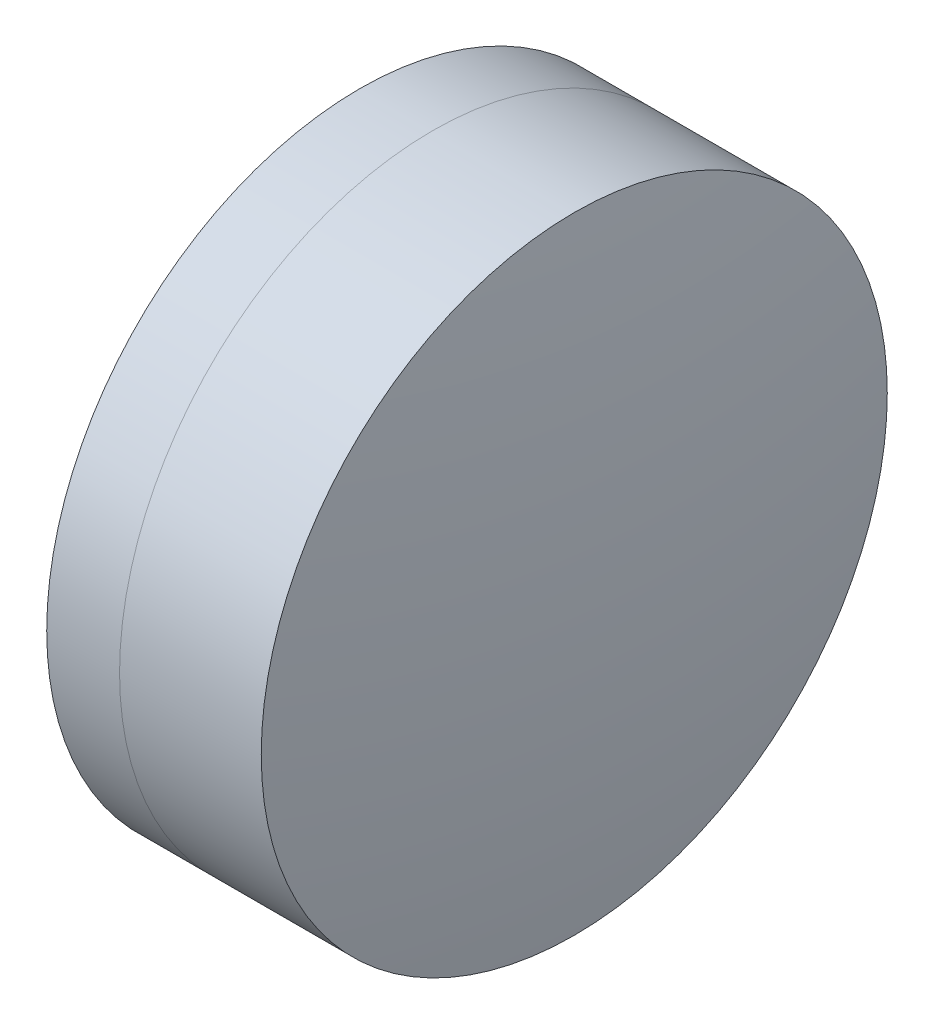
ISO-10303-21;
HEADER;
FILE_DESCRIPTION(('STEP AP214'),'2;1');
FILE_NAME('part.step','',(''),(''),'','','');
FILE_SCHEMA(('AUTOMOTIVE_DESIGN { 1 0 10303 214 1 1 1 1 }'));
ENDSEC;
DATA;
#1=APPLICATION_CONTEXT('core data for automotive mechanical design processes');
#2=APPLICATION_PROTOCOL_DEFINITION('international standard','automotive_design',2000,#1);
#3=PRODUCT_CONTEXT('',#1,'mechanical');
#4=PRODUCT('Part','Part','',(#3));
#5=PRODUCT_RELATED_PRODUCT_CATEGORY('part','',(#4));
#6=PRODUCT_DEFINITION_FORMATION('','',#4);
#7=PRODUCT_DEFINITION_CONTEXT('part definition',#1,'design');
#8=PRODUCT_DEFINITION('design','',#6,#7);
#9=PRODUCT_DEFINITION_SHAPE('','',#8);
#10=(LENGTH_UNIT() NAMED_UNIT(*) SI_UNIT(.MILLI.,.METRE.));
#11=(NAMED_UNIT(*) PLANE_ANGLE_UNIT() SI_UNIT($,.RADIAN.));
#12=(NAMED_UNIT(*) SI_UNIT($,.STERADIAN.) SOLID_ANGLE_UNIT());
#13=UNCERTAINTY_MEASURE_WITH_UNIT(LENGTH_MEASURE(1.E-05),#10,'distance_accuracy_value','');
#14=(GEOMETRIC_REPRESENTATION_CONTEXT(3) GLOBAL_UNCERTAINTY_ASSIGNED_CONTEXT((#13)) GLOBAL_UNIT_ASSIGNED_CONTEXT((#10,
#11,#12)) REPRESENTATION_CONTEXT('',''));
#15=CARTESIAN_POINT('',(0.,0.,0.));
#16=DIRECTION('',(0.,0.,1.));
#17=DIRECTION('',(1.,0.,0.));
#18=AXIS2_PLACEMENT_3D('',#15,#16,#17);
#19=CARTESIAN_POINT('',(-11.8070792192613,0.,0.));
#20=DIRECTION('',(-1.,0.,0.));
#21=DIRECTION('',(0.,0.,1.));
#22=AXIS2_PLACEMENT_3D('',#19,#20,#21);
#23=SPHERICAL_SURFACE('',#22,14.496);
#24=CARTESIAN_POINT('',(1.27235180811907,0.,0.));
#25=DIRECTION('',(-1.,0.,0.));
#26=DIRECTION('',(0.,0.,1.));
#27=AXIS2_PLACEMENT_3D('',#24,#25,#26);
#28=CIRCLE('',#27,6.25);
#29=CARTESIAN_POINT('',(1.27235180811907,0.,6.25));
#30=VERTEX_POINT('',#29);
#31=EDGE_CURVE('E11',#30,#30,#28,.T.);
#32=ORIENTED_EDGE('',*,*,#31,.T.);
#33=EDGE_LOOP('',(#32));
#34=FACE_BOUND('',#33,.T.);
#35=ADVANCED_FACE('F45',(#34),#23,.F.);
#36=CARTESIAN_POINT('',(-0.551919992657797,0.,0.));
#37=DIRECTION('',(-1.,0.,0.));
#38=DIRECTION('',(0.,0.,1.));
#39=AXIS2_PLACEMENT_3D('',#36,#37,#38);
#40=CYLINDRICAL_SURFACE('',#39,6.25);
#41=CARTESIAN_POINT('',(4.1013985704652,0.,0.));
#42=DIRECTION('',(-1.,0.,0.));
#43=DIRECTION('',(0.,0.,1.));
#44=AXIS2_PLACEMENT_3D('',#41,#42,#43);
#45=CIRCLE('',#44,6.25);
#46=CARTESIAN_POINT('',(4.1013985704652,0.,6.25));
#47=VERTEX_POINT('',#46);
#48=EDGE_CURVE('E51',#47,#47,#45,.T.);
#49=ORIENTED_EDGE('',*,*,#48,.T.);
#50=EDGE_LOOP('',(#49));
#51=FACE_BOUND('',#50,.T.);
#52=ORIENTED_EDGE('',*,*,#31,.F.);
#53=EDGE_LOOP('',(#52));
#54=FACE_BOUND('',#53,.T.);
#55=ADVANCED_FACE('F57',(#51,#54),#40,.T.);
#56=CARTESIAN_POINT('',(-36.5610792192613,0.,0.));
#57=DIRECTION('',(-1.,0.,0.));
#58=DIRECTION('',(0.,0.,1.));
#59=AXIS2_PLACEMENT_3D('',#56,#57,#58);
#60=SPHERICAL_SURFACE('',#59,41.14);
#61=ORIENTED_EDGE('',*,*,#48,.F.);
#62=EDGE_LOOP('',(#61));
#63=FACE_BOUND('',#62,.T.);
#64=ADVANCED_FACE('F60',(#63),#60,.T.);
#65=CLOSED_SHELL('',(#35,#55,#64));
#66=MANIFOLD_SOLID_BREP('B2',#65);
#67=CARTESIAN_POINT('',(19.2789207807387,0.,0.));
#68=DIRECTION('',(-1.,0.,0.));
#69=DIRECTION('',(0.,0.,1.));
#70=AXIS2_PLACEMENT_3D('',#67,#68,#69);
#71=SPHERICAL_SURFACE('',#70,20.44);
#72=CARTESIAN_POINT('',(-0.182094095161263,0.,0.));
#73=DIRECTION('',(-1.,0.,0.));
#74=DIRECTION('',(0.,0.,1.));
#75=AXIS2_PLACEMENT_3D('',#72,#73,#74);
#76=CIRCLE('',#75,6.25);
#77=CARTESIAN_POINT('',(-0.182094095161263,0.,6.25));
#78=VERTEX_POINT('',#77);
#79=EDGE_CURVE('E44',#78,#78,#76,.T.);
#80=ORIENTED_EDGE('',*,*,#79,.T.);
#81=EDGE_LOOP('',(#80));
#82=FACE_BOUND('',#81,.T.);
#83=ADVANCED_FACE('F86',(#82),#71,.T.);
#84=CARTESIAN_POINT('',(-9.70261217833668,0.,0.));
#85=DIRECTION('',(-1.,0.,0.));
#86=DIRECTION('',(0.,0.,1.));
#87=AXIS2_PLACEMENT_3D('',#84,#85,#86);
#88=CYLINDRICAL_SURFACE('',#87,6.25);
#89=CARTESIAN_POINT('',(1.27235180811907,0.,0.));
#90=DIRECTION('',(-1.,0.,0.));
#91=DIRECTION('',(0.,0.,1.));
#92=AXIS2_PLACEMENT_3D('',#89,#90,#91);
#93=CIRCLE('',#92,6.25);
#94=CARTESIAN_POINT('',(1.27235180811907,0.,6.25));
#95=VERTEX_POINT('',#94);
#96=EDGE_CURVE('E92',#95,#95,#93,.T.);
#97=ORIENTED_EDGE('',*,*,#96,.T.);
#98=EDGE_LOOP('',(#97));
#99=FACE_BOUND('',#98,.T.);
#100=ORIENTED_EDGE('',*,*,#79,.F.);
#101=EDGE_LOOP('',(#100));
#102=FACE_BOUND('',#101,.T.);
#103=ADVANCED_FACE('F98',(#99,#102),#88,.T.);
#104=CARTESIAN_POINT('',(-11.8070792192613,0.,0.));
#105=DIRECTION('',(-1.,0.,0.));
#106=DIRECTION('',(0.,0.,1.));
#107=AXIS2_PLACEMENT_3D('',#104,#105,#106);
#108=SPHERICAL_SURFACE('',#107,14.496);
#109=ORIENTED_EDGE('',*,*,#96,.F.);
#110=EDGE_LOOP('',(#109));
#111=FACE_BOUND('',#110,.T.);
#112=ADVANCED_FACE('F101',(#111),#108,.T.);
#113=CLOSED_SHELL('',(#83,#103,#112));
#114=MANIFOLD_SOLID_BREP('B6',#113);
#115=ADVANCED_BREP_SHAPE_REPRESENTATION('',(#18,#66,#114),#14);
#116=SHAPE_DEFINITION_REPRESENTATION(#9,#115);
ENDSEC;
END-ISO-10303-21;
